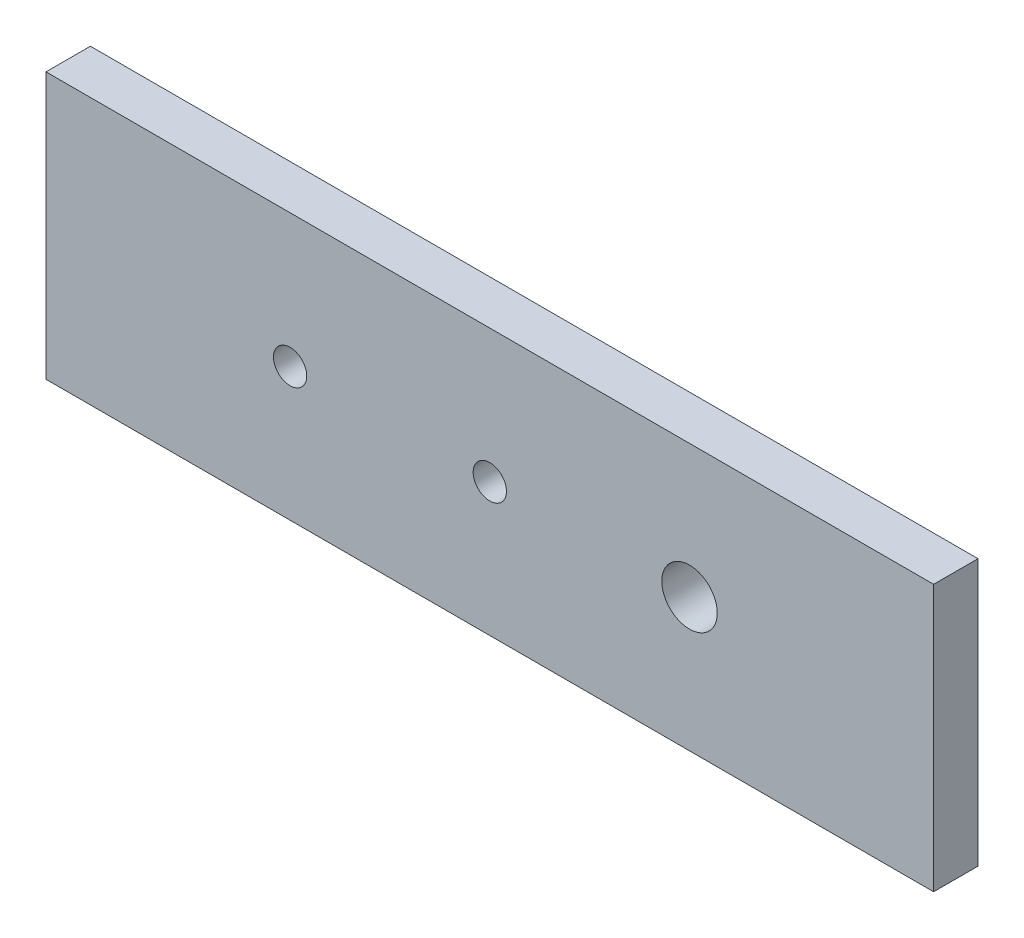
ISO-10303-21;
HEADER;
FILE_DESCRIPTION(('STEP AP214'),'2;1');
FILE_NAME('part.step','',(''),(''),'','','');
FILE_SCHEMA(('AUTOMOTIVE_DESIGN { 1 0 10303 214 1 1 1 1 }'));
ENDSEC;
DATA;
#1=APPLICATION_CONTEXT('core data for automotive mechanical design processes');
#2=APPLICATION_PROTOCOL_DEFINITION('international standard','automotive_design',2000,#1);
#3=PRODUCT_CONTEXT('',#1,'mechanical');
#4=PRODUCT('Part','Part','',(#3));
#5=PRODUCT_RELATED_PRODUCT_CATEGORY('part','',(#4));
#6=PRODUCT_DEFINITION_FORMATION('','',#4);
#7=PRODUCT_DEFINITION_CONTEXT('part definition',#1,'design');
#8=PRODUCT_DEFINITION('design','',#6,#7);
#9=PRODUCT_DEFINITION_SHAPE('','',#8);
#10=(LENGTH_UNIT() NAMED_UNIT(*) SI_UNIT(.MILLI.,.METRE.));
#11=(NAMED_UNIT(*) PLANE_ANGLE_UNIT() SI_UNIT($,.RADIAN.));
#12=(NAMED_UNIT(*) SI_UNIT($,.STERADIAN.) SOLID_ANGLE_UNIT());
#13=UNCERTAINTY_MEASURE_WITH_UNIT(LENGTH_MEASURE(1.E-05),#10,'distance_accuracy_value','');
#14=(GEOMETRIC_REPRESENTATION_CONTEXT(3) GLOBAL_UNCERTAINTY_ASSIGNED_CONTEXT((#13)) GLOBAL_UNIT_ASSIGNED_CONTEXT((#10,
#11,#12)) REPRESENTATION_CONTEXT('',''));
#15=CARTESIAN_POINT('',(0.,0.,0.));
#16=DIRECTION('',(0.,0.,1.));
#17=DIRECTION('',(1.,0.,0.));
#18=AXIS2_PLACEMENT_3D('',#15,#16,#17);
#19=CARTESIAN_POINT('',(0.,0.,25.4));
#20=DIRECTION('',(0.,0.,-1.));
#21=DIRECTION('',(-1.,0.,0.));
#22=AXIS2_PLACEMENT_3D('',#19,#20,#21);
#23=PLANE('',#22);
#24=DIRECTION('',(0.,1.,0.));
#25=VECTOR('',#24,1.);
#26=CARTESIAN_POINT('',(254.,-76.2,25.4));
#27=LINE('',#26,#25);
#28=CARTESIAN_POINT('',(254.,-76.2,25.4));
#29=VERTEX_POINT('',#28);
#30=CARTESIAN_POINT('',(254.,76.2,25.4));
#31=VERTEX_POINT('',#30);
#32=EDGE_CURVE('E85',#29,#31,#27,.T.);
#33=ORIENTED_EDGE('',*,*,#32,.T.);
#34=DIRECTION('',(-1.,0.,0.));
#35=VECTOR('',#34,1.);
#36=CARTESIAN_POINT('',(-254.,76.2,25.4));
#37=LINE('',#36,#35);
#38=CARTESIAN_POINT('',(-254.,76.2,25.4));
#39=VERTEX_POINT('',#38);
#40=EDGE_CURVE('E80',#31,#39,#37,.T.);
#41=ORIENTED_EDGE('',*,*,#40,.T.);
#42=DIRECTION('',(0.,-1.,0.));
#43=VECTOR('',#42,1.);
#44=CARTESIAN_POINT('',(-254.,-76.2,25.4));
#45=LINE('',#44,#43);
#46=CARTESIAN_POINT('',(-254.,-76.2,25.4));
#47=VERTEX_POINT('',#46);
#48=EDGE_CURVE('E83',#39,#47,#45,.T.);
#49=ORIENTED_EDGE('',*,*,#48,.T.);
#50=DIRECTION('',(1.,0.,0.));
#51=VECTOR('',#50,1.);
#52=CARTESIAN_POINT('',(-254.,-76.2,25.4));
#53=LINE('',#52,#51);
#54=EDGE_CURVE('E50',#47,#29,#53,.T.);
#55=ORIENTED_EDGE('',*,*,#54,.T.);
#56=EDGE_LOOP('',(#33,#41,#49,#55));
#57=FACE_BOUND('',#56,.T.);
#58=CARTESIAN_POINT('',(-114.3,0.,25.4));
#59=DIRECTION('',(0.,0.,1.));
#60=DIRECTION('',(1.,0.,0.));
#61=AXIS2_PLACEMENT_3D('',#58,#59,#60);
#62=CIRCLE('',#61,9.52499999999999);
#63=CARTESIAN_POINT('',(-104.775,0.,25.4));
#64=VERTEX_POINT('',#63);
#65=EDGE_CURVE('E100',#64,#64,#62,.T.);
#66=ORIENTED_EDGE('',*,*,#65,.F.);
#67=EDGE_LOOP('',(#66));
#68=FACE_BOUND('',#67,.T.);
#69=CARTESIAN_POINT('',(0.,0.,25.4));
#70=DIRECTION('',(0.,0.,1.));
#71=DIRECTION('',(1.,0.,0.));
#72=AXIS2_PLACEMENT_3D('',#69,#70,#71);
#73=CIRCLE('',#72,9.525);
#74=CARTESIAN_POINT('',(9.52500000000005,0.,25.4));
#75=VERTEX_POINT('',#74);
#76=EDGE_CURVE('E115',#75,#75,#73,.T.);
#77=ORIENTED_EDGE('',*,*,#76,.F.);
#78=EDGE_LOOP('',(#77));
#79=FACE_BOUND('',#78,.T.);
#80=CARTESIAN_POINT('',(114.3,0.,25.4));
#81=DIRECTION('',(0.,0.,1.));
#82=DIRECTION('',(1.,0.,0.));
#83=AXIS2_PLACEMENT_3D('',#80,#81,#82);
#84=CIRCLE('',#83,15.875);
#85=CARTESIAN_POINT('',(130.175,0.,25.4));
#86=VERTEX_POINT('',#85);
#87=EDGE_CURVE('E121',#86,#86,#84,.T.);
#88=ORIENTED_EDGE('',*,*,#87,.F.);
#89=EDGE_LOOP('',(#88));
#90=FACE_BOUND('',#89,.T.);
#91=ADVANCED_FACE('F33',(#57,#68,#79,#90),#23,.F.);
#92=CARTESIAN_POINT('',(0.,0.,0.));
#93=DIRECTION('',(0.,0.,-1.));
#94=DIRECTION('',(-1.,0.,0.));
#95=AXIS2_PLACEMENT_3D('',#92,#93,#94);
#96=PLANE('',#95);
#97=CARTESIAN_POINT('',(0.,0.,0.));
#98=DIRECTION('',(0.,0.,1.));
#99=DIRECTION('',(1.,0.,0.));
#100=AXIS2_PLACEMENT_3D('',#97,#98,#99);
#101=CIRCLE('',#100,9.525);
#102=CARTESIAN_POINT('',(9.52500000000005,0.,0.));
#103=VERTEX_POINT('',#102);
#104=EDGE_CURVE('E118',#103,#103,#101,.T.);
#105=ORIENTED_EDGE('',*,*,#104,.T.);
#106=EDGE_LOOP('',(#105));
#107=FACE_BOUND('',#106,.T.);
#108=DIRECTION('',(0.,1.,0.));
#109=VECTOR('',#108,1.);
#110=CARTESIAN_POINT('',(254.,-76.2,0.));
#111=LINE('',#110,#109);
#112=CARTESIAN_POINT('',(254.,-76.2,0.));
#113=VERTEX_POINT('',#112);
#114=CARTESIAN_POINT('',(254.,76.2,0.));
#115=VERTEX_POINT('',#114);
#116=EDGE_CURVE('E97',#113,#115,#111,.T.);
#117=ORIENTED_EDGE('',*,*,#116,.F.);
#118=DIRECTION('',(1.,0.,0.));
#119=VECTOR('',#118,1.);
#120=CARTESIAN_POINT('',(-254.,-76.2,0.));
#121=LINE('',#120,#119);
#122=CARTESIAN_POINT('',(-254.,-76.2,0.));
#123=VERTEX_POINT('',#122);
#124=EDGE_CURVE('E73',#123,#113,#121,.T.);
#125=ORIENTED_EDGE('',*,*,#124,.F.);
#126=DIRECTION('',(0.,-1.,0.));
#127=VECTOR('',#126,1.);
#128=CARTESIAN_POINT('',(-254.,-76.2,0.));
#129=LINE('',#128,#127);
#130=CARTESIAN_POINT('',(-254.,76.2,0.));
#131=VERTEX_POINT('',#130);
#132=EDGE_CURVE('E67',#131,#123,#129,.T.);
#133=ORIENTED_EDGE('',*,*,#132,.F.);
#134=DIRECTION('',(-1.,0.,0.));
#135=VECTOR('',#134,1.);
#136=CARTESIAN_POINT('',(-254.,76.2,0.));
#137=LINE('',#136,#135);
#138=EDGE_CURVE('E89',#115,#131,#137,.T.);
#139=ORIENTED_EDGE('',*,*,#138,.F.);
#140=EDGE_LOOP('',(#117,#125,#133,#139));
#141=FACE_BOUND('',#140,.T.);
#142=CARTESIAN_POINT('',(-114.3,0.,0.));
#143=DIRECTION('',(0.,0.,1.));
#144=DIRECTION('',(1.,0.,0.));
#145=AXIS2_PLACEMENT_3D('',#142,#143,#144);
#146=CIRCLE('',#145,9.52499999999999);
#147=CARTESIAN_POINT('',(-104.775,0.,0.));
#148=VERTEX_POINT('',#147);
#149=EDGE_CURVE('E112',#148,#148,#146,.T.);
#150=ORIENTED_EDGE('',*,*,#149,.T.);
#151=EDGE_LOOP('',(#150));
#152=FACE_BOUND('',#151,.T.);
#153=CARTESIAN_POINT('',(114.3,0.,0.));
#154=DIRECTION('',(0.,0.,1.));
#155=DIRECTION('',(1.,0.,0.));
#156=AXIS2_PLACEMENT_3D('',#153,#154,#155);
#157=CIRCLE('',#156,15.875);
#158=CARTESIAN_POINT('',(130.175,0.,0.));
#159=VERTEX_POINT('',#158);
#160=EDGE_CURVE('E124',#159,#159,#157,.T.);
#161=ORIENTED_EDGE('',*,*,#160,.T.);
#162=EDGE_LOOP('',(#161));
#163=FACE_BOUND('',#162,.T.);
#164=ADVANCED_FACE('F108',(#107,#141,#152,#163),#96,.T.);
#165=CARTESIAN_POINT('',(254.,-76.2,25.4));
#166=DIRECTION('',(-1.,0.,0.));
#167=DIRECTION('',(0.,0.,1.));
#168=AXIS2_PLACEMENT_3D('',#165,#166,#167);
#169=PLANE('',#168);
#170=ORIENTED_EDGE('',*,*,#116,.T.);
#171=DIRECTION('',(0.,0.,-1.));
#172=VECTOR('',#171,1.);
#173=CARTESIAN_POINT('',(254.,76.2,25.4));
#174=LINE('',#173,#172);
#175=EDGE_CURVE('E11',#31,#115,#174,.T.);
#176=ORIENTED_EDGE('',*,*,#175,.F.);
#177=ORIENTED_EDGE('',*,*,#32,.F.);
#178=DIRECTION('',(0.,0.,-1.));
#179=VECTOR('',#178,1.);
#180=CARTESIAN_POINT('',(254.,-76.2,25.4));
#181=LINE('',#180,#179);
#182=EDGE_CURVE('E93',#29,#113,#181,.T.);
#183=ORIENTED_EDGE('',*,*,#182,.T.);
#184=EDGE_LOOP('',(#170,#176,#177,#183));
#185=FACE_BOUND('',#184,.T.);
#186=ADVANCED_FACE('F35',(#185),#169,.F.);
#187=CARTESIAN_POINT('',(-254.,76.2,25.4));
#188=DIRECTION('',(0.,-1.,0.));
#189=DIRECTION('',(0.,0.,-1.));
#190=AXIS2_PLACEMENT_3D('',#187,#188,#189);
#191=PLANE('',#190);
#192=ORIENTED_EDGE('',*,*,#138,.T.);
#193=DIRECTION('',(0.,0.,-1.));
#194=VECTOR('',#193,1.);
#195=CARTESIAN_POINT('',(-254.,76.2,25.4));
#196=LINE('',#195,#194);
#197=EDGE_CURVE('E42',#39,#131,#196,.T.);
#198=ORIENTED_EDGE('',*,*,#197,.F.);
#199=ORIENTED_EDGE('',*,*,#40,.F.);
#200=ORIENTED_EDGE('',*,*,#175,.T.);
#201=EDGE_LOOP('',(#192,#198,#199,#200));
#202=FACE_BOUND('',#201,.T.);
#203=ADVANCED_FACE('F88',(#202),#191,.F.);
#204=CARTESIAN_POINT('',(-254.,-76.2,25.4));
#205=DIRECTION('',(1.,0.,0.));
#206=DIRECTION('',(0.,0.,-1.));
#207=AXIS2_PLACEMENT_3D('',#204,#205,#206);
#208=PLANE('',#207);
#209=ORIENTED_EDGE('',*,*,#132,.T.);
#210=DIRECTION('',(0.,0.,-1.));
#211=VECTOR('',#210,1.);
#212=CARTESIAN_POINT('',(-254.,-76.2,25.4));
#213=LINE('',#212,#211);
#214=EDGE_CURVE('E90',#47,#123,#213,.T.);
#215=ORIENTED_EDGE('',*,*,#214,.F.);
#216=ORIENTED_EDGE('',*,*,#48,.F.);
#217=ORIENTED_EDGE('',*,*,#197,.T.);
#218=EDGE_LOOP('',(#209,#215,#216,#217));
#219=FACE_BOUND('',#218,.T.);
#220=ADVANCED_FACE('F91',(#219),#208,.F.);
#221=CARTESIAN_POINT('',(-254.,-76.2,25.4));
#222=DIRECTION('',(0.,1.,0.));
#223=DIRECTION('',(0.,0.,1.));
#224=AXIS2_PLACEMENT_3D('',#221,#222,#223);
#225=PLANE('',#224);
#226=ORIENTED_EDGE('',*,*,#124,.T.);
#227=ORIENTED_EDGE('',*,*,#182,.F.);
#228=ORIENTED_EDGE('',*,*,#54,.F.);
#229=ORIENTED_EDGE('',*,*,#214,.T.);
#230=EDGE_LOOP('',(#226,#227,#228,#229));
#231=FACE_BOUND('',#230,.T.);
#232=ADVANCED_FACE('F105',(#231),#225,.F.);
#233=CARTESIAN_POINT('',(-114.3,0.,25.4));
#234=DIRECTION('',(0.,0.,-1.));
#235=DIRECTION('',(-1.,0.,0.));
#236=AXIS2_PLACEMENT_3D('',#233,#234,#235);
#237=CYLINDRICAL_SURFACE('',#236,9.52499999999999);
#238=ORIENTED_EDGE('',*,*,#65,.T.);
#239=EDGE_LOOP('',(#238));
#240=FACE_BOUND('',#239,.T.);
#241=ORIENTED_EDGE('',*,*,#149,.F.);
#242=EDGE_LOOP('',(#241));
#243=FACE_BOUND('',#242,.T.);
#244=ADVANCED_FACE('F141',(#240,#243),#237,.F.);
#245=CARTESIAN_POINT('',(0.,0.,25.4));
#246=DIRECTION('',(0.,0.,-1.));
#247=DIRECTION('',(-1.,0.,0.));
#248=AXIS2_PLACEMENT_3D('',#245,#246,#247);
#249=CYLINDRICAL_SURFACE('',#248,9.525);
#250=ORIENTED_EDGE('',*,*,#76,.T.);
#251=EDGE_LOOP('',(#250));
#252=FACE_BOUND('',#251,.T.);
#253=ORIENTED_EDGE('',*,*,#104,.F.);
#254=EDGE_LOOP('',(#253));
#255=FACE_BOUND('',#254,.T.);
#256=ADVANCED_FACE('F187',(#252,#255),#249,.F.);
#257=CARTESIAN_POINT('',(114.3,0.,25.4));
#258=DIRECTION('',(0.,0.,-1.));
#259=DIRECTION('',(-1.,0.,0.));
#260=AXIS2_PLACEMENT_3D('',#257,#258,#259);
#261=CYLINDRICAL_SURFACE('',#260,15.875);
#262=ORIENTED_EDGE('',*,*,#87,.T.);
#263=EDGE_LOOP('',(#262));
#264=FACE_BOUND('',#263,.T.);
#265=ORIENTED_EDGE('',*,*,#160,.F.);
#266=EDGE_LOOP('',(#265));
#267=FACE_BOUND('',#266,.T.);
#268=ADVANCED_FACE('F130',(#264,#267),#261,.F.);
#269=CLOSED_SHELL('',(#91,#164,#186,#203,#220,#232,#244,#256,#268));
#270=MANIFOLD_SOLID_BREP('B2',#269);
#271=ADVANCED_BREP_SHAPE_REPRESENTATION('',(#18,#270),#14);
#272=SHAPE_DEFINITION_REPRESENTATION(#9,#271);
ENDSEC;
END-ISO-10303-21;
